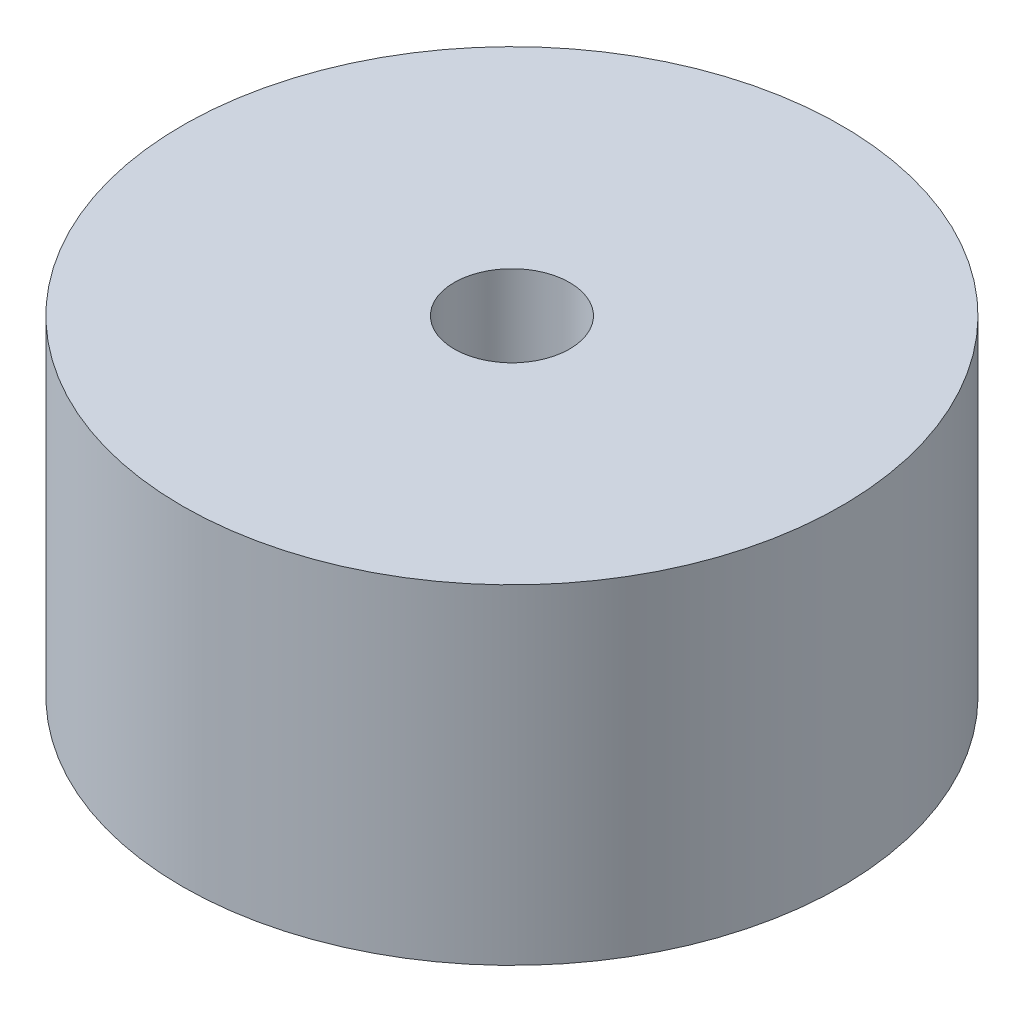
ISO-10303-21;
HEADER;
FILE_DESCRIPTION(('STEP AP214'),'2;1');
FILE_NAME('part.step','',(''),(''),'','','');
FILE_SCHEMA(('AUTOMOTIVE_DESIGN { 1 0 10303 214 1 1 1 1 }'));
ENDSEC;
DATA;
#1=APPLICATION_CONTEXT('core data for automotive mechanical design processes');
#2=APPLICATION_PROTOCOL_DEFINITION('international standard','automotive_design',2000,#1);
#3=PRODUCT_CONTEXT('',#1,'mechanical');
#4=PRODUCT('Part','Part','',(#3));
#5=PRODUCT_RELATED_PRODUCT_CATEGORY('part','',(#4));
#6=PRODUCT_DEFINITION_FORMATION('','',#4);
#7=PRODUCT_DEFINITION_CONTEXT('part definition',#1,'design');
#8=PRODUCT_DEFINITION('design','',#6,#7);
#9=PRODUCT_DEFINITION_SHAPE('','',#8);
#10=(LENGTH_UNIT() NAMED_UNIT(*) SI_UNIT(.MILLI.,.METRE.));
#11=(NAMED_UNIT(*) PLANE_ANGLE_UNIT() SI_UNIT($,.RADIAN.));
#12=(NAMED_UNIT(*) SI_UNIT($,.STERADIAN.) SOLID_ANGLE_UNIT());
#13=UNCERTAINTY_MEASURE_WITH_UNIT(LENGTH_MEASURE(1.E-05),#10,'distance_accuracy_value','');
#14=(GEOMETRIC_REPRESENTATION_CONTEXT(3) GLOBAL_UNCERTAINTY_ASSIGNED_CONTEXT((#13)) GLOBAL_UNIT_ASSIGNED_CONTEXT((#10,
#11,#12)) REPRESENTATION_CONTEXT('',''));
#15=CARTESIAN_POINT('',(0.,0.,0.));
#16=DIRECTION('',(0.,0.,1.));
#17=DIRECTION('',(1.,0.,0.));
#18=AXIS2_PLACEMENT_3D('',#15,#16,#17);
#19=CARTESIAN_POINT('',(0.,10.,0.));
#20=DIRECTION('',(0.,-1.,0.));
#21=DIRECTION('',(0.,0.,-1.));
#22=AXIS2_PLACEMENT_3D('',#19,#20,#21);
#23=CYLINDRICAL_SURFACE('',#22,1.75);
#24=CARTESIAN_POINT('',(0.,10.,0.));
#25=DIRECTION('',(0.,1.,0.));
#26=DIRECTION('',(0.,0.,1.));
#27=AXIS2_PLACEMENT_3D('',#24,#25,#26);
#28=CIRCLE('',#27,1.75);
#29=CARTESIAN_POINT('',(0.,10.,1.75));
#30=VERTEX_POINT('',#29);
#31=EDGE_CURVE('E44',#30,#30,#28,.T.);
#32=ORIENTED_EDGE('',*,*,#31,.T.);
#33=EDGE_LOOP('',(#32));
#34=FACE_BOUND('',#33,.T.);
#35=CARTESIAN_POINT('',(0.,5.,0.));
#36=DIRECTION('',(0.,-1.,0.));
#37=DIRECTION('',(0.,0.,-1.));
#38=AXIS2_PLACEMENT_3D('',#35,#36,#37);
#39=CIRCLE('',#38,1.75);
#40=CARTESIAN_POINT('',(0.,5.,-1.75));
#41=VERTEX_POINT('',#40);
#42=EDGE_CURVE('E35',#41,#41,#39,.T.);
#43=ORIENTED_EDGE('',*,*,#42,.T.);
#44=EDGE_LOOP('',(#43));
#45=FACE_BOUND('',#44,.T.);
#46=ADVANCED_FACE('F31',(#34,#45),#23,.F.);
#47=CARTESIAN_POINT('',(0.,10.,0.));
#48=DIRECTION('',(0.,1.,0.));
#49=DIRECTION('',(0.,0.,1.));
#50=AXIS2_PLACEMENT_3D('',#47,#48,#49);
#51=PLANE('',#50);
#52=CARTESIAN_POINT('',(0.,10.,0.));
#53=DIRECTION('',(0.,1.,0.));
#54=DIRECTION('',(0.,0.,1.));
#55=AXIS2_PLACEMENT_3D('',#52,#53,#54);
#56=CIRCLE('',#55,10.);
#57=CARTESIAN_POINT('',(0.,10.,10.));
#58=VERTEX_POINT('',#57);
#59=EDGE_CURVE('E10',#58,#58,#56,.T.);
#60=ORIENTED_EDGE('',*,*,#59,.T.);
#61=EDGE_LOOP('',(#60));
#62=FACE_BOUND('',#61,.T.);
#63=ORIENTED_EDGE('',*,*,#31,.F.);
#64=EDGE_LOOP('',(#63));
#65=FACE_BOUND('',#64,.T.);
#66=ADVANCED_FACE('F69',(#62,#65),#51,.T.);
#67=CARTESIAN_POINT('',(0.,0.,0.));
#68=DIRECTION('',(0.,1.,0.));
#69=DIRECTION('',(0.,0.,1.));
#70=AXIS2_PLACEMENT_3D('',#67,#68,#69);
#71=PLANE('',#70);
#72=CARTESIAN_POINT('',(0.,0.,0.));
#73=DIRECTION('',(0.,-1.,0.));
#74=DIRECTION('',(0.,0.,-1.));
#75=AXIS2_PLACEMENT_3D('',#72,#73,#74);
#76=CIRCLE('',#75,3.2);
#77=CARTESIAN_POINT('',(0.,0.,-3.2));
#78=VERTEX_POINT('',#77);
#79=EDGE_CURVE('E48',#78,#78,#76,.T.);
#80=ORIENTED_EDGE('',*,*,#79,.F.);
#81=EDGE_LOOP('',(#80));
#82=FACE_BOUND('',#81,.T.);
#83=CARTESIAN_POINT('',(0.,0.,0.));
#84=DIRECTION('',(0.,1.,0.));
#85=DIRECTION('',(0.,0.,1.));
#86=AXIS2_PLACEMENT_3D('',#83,#84,#85);
#87=CIRCLE('',#86,10.);
#88=CARTESIAN_POINT('',(0.,0.,10.));
#89=VERTEX_POINT('',#88);
#90=EDGE_CURVE('E39',#89,#89,#87,.T.);
#91=ORIENTED_EDGE('',*,*,#90,.F.);
#92=EDGE_LOOP('',(#91));
#93=FACE_BOUND('',#92,.T.);
#94=ADVANCED_FACE('F75',(#82,#93),#71,.F.);
#95=CARTESIAN_POINT('',(0.,10.,0.));
#96=DIRECTION('',(0.,-1.,0.));
#97=DIRECTION('',(0.,0.,-1.));
#98=AXIS2_PLACEMENT_3D('',#95,#96,#97);
#99=CYLINDRICAL_SURFACE('',#98,10.);
#100=ORIENTED_EDGE('',*,*,#59,.F.);
#101=EDGE_LOOP('',(#100));
#102=FACE_BOUND('',#101,.T.);
#103=ORIENTED_EDGE('',*,*,#90,.T.);
#104=EDGE_LOOP('',(#103));
#105=FACE_BOUND('',#104,.T.);
#106=ADVANCED_FACE('F33',(#102,#105),#99,.T.);
#107=CARTESIAN_POINT('',(0.,5.,0.));
#108=DIRECTION('',(0.,-1.,0.));
#109=DIRECTION('',(0.,0.,-1.));
#110=AXIS2_PLACEMENT_3D('',#107,#108,#109);
#111=CYLINDRICAL_SURFACE('',#110,3.2);
#112=CARTESIAN_POINT('',(0.,5.,0.));
#113=DIRECTION('',(0.,-1.,0.));
#114=DIRECTION('',(0.,0.,-1.));
#115=AXIS2_PLACEMENT_3D('',#112,#113,#114);
#116=CIRCLE('',#115,3.2);
#117=CARTESIAN_POINT('',(0.,5.,-3.2));
#118=VERTEX_POINT('',#117);
#119=EDGE_CURVE('E51',#118,#118,#116,.T.);
#120=ORIENTED_EDGE('',*,*,#119,.F.);
#121=EDGE_LOOP('',(#120));
#122=FACE_BOUND('',#121,.T.);
#123=ORIENTED_EDGE('',*,*,#79,.T.);
#124=EDGE_LOOP('',(#123));
#125=FACE_BOUND('',#124,.T.);
#126=ADVANCED_FACE('F61',(#122,#125),#111,.F.);
#127=CARTESIAN_POINT('',(0.,5.,0.));
#128=DIRECTION('',(0.,-1.,0.));
#129=DIRECTION('',(0.,0.,-1.));
#130=AXIS2_PLACEMENT_3D('',#127,#128,#129);
#131=PLANE('',#130);
#132=ORIENTED_EDGE('',*,*,#42,.F.);
#133=EDGE_LOOP('',(#132));
#134=FACE_BOUND('',#133,.T.);
#135=ORIENTED_EDGE('',*,*,#119,.T.);
#136=EDGE_LOOP('',(#135));
#137=FACE_BOUND('',#136,.T.);
#138=ADVANCED_FACE('F59',(#134,#137),#131,.T.);
#139=CLOSED_SHELL('',(#46,#66,#94,#106,#126,#138));
#140=MANIFOLD_SOLID_BREP('B2',#139);
#141=ADVANCED_BREP_SHAPE_REPRESENTATION('',(#18,#140),#14);
#142=SHAPE_DEFINITION_REPRESENTATION(#9,#141);
ENDSEC;
END-ISO-10303-21;
